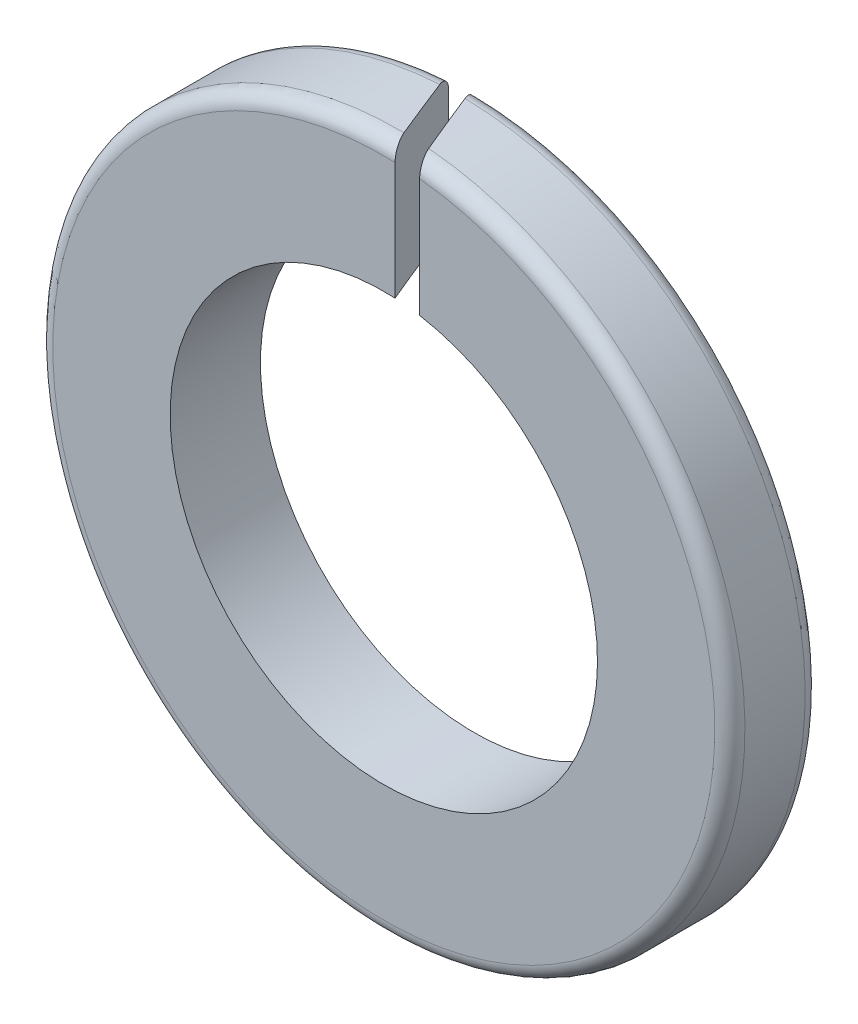
ISO-10303-21;
HEADER;
FILE_DESCRIPTION(('STEP AP214'),'2;1');
FILE_NAME('part.step','',(''),(''),'','','');
FILE_SCHEMA(('AUTOMOTIVE_DESIGN { 1 0 10303 214 1 1 1 1 }'));
ENDSEC;
DATA;
#1=APPLICATION_CONTEXT('core data for automotive mechanical design processes');
#2=APPLICATION_PROTOCOL_DEFINITION('international standard','automotive_design',2000,#1);
#3=PRODUCT_CONTEXT('',#1,'mechanical');
#4=PRODUCT('Part','Part','',(#3));
#5=PRODUCT_RELATED_PRODUCT_CATEGORY('part','',(#4));
#6=PRODUCT_DEFINITION_FORMATION('','',#4);
#7=PRODUCT_DEFINITION_CONTEXT('part definition',#1,'design');
#8=PRODUCT_DEFINITION('design','',#6,#7);
#9=PRODUCT_DEFINITION_SHAPE('','',#8);
#10=(LENGTH_UNIT() NAMED_UNIT(*) SI_UNIT(.MILLI.,.METRE.));
#11=(NAMED_UNIT(*) PLANE_ANGLE_UNIT() SI_UNIT($,.RADIAN.));
#12=(NAMED_UNIT(*) SI_UNIT($,.STERADIAN.) SOLID_ANGLE_UNIT());
#13=UNCERTAINTY_MEASURE_WITH_UNIT(LENGTH_MEASURE(1.E-05),#10,'distance_accuracy_value','');
#14=(GEOMETRIC_REPRESENTATION_CONTEXT(3) GLOBAL_UNCERTAINTY_ASSIGNED_CONTEXT((#13)) GLOBAL_UNIT_ASSIGNED_CONTEXT((#10,
#11,#12)) REPRESENTATION_CONTEXT('',''));
#15=CARTESIAN_POINT('',(0.,0.,0.));
#16=DIRECTION('',(0.,0.,1.));
#17=DIRECTION('',(1.,0.,0.));
#18=AXIS2_PLACEMENT_3D('',#15,#16,#17);
#19=CARTESIAN_POINT('',(0.,0.,3.));
#20=DIRECTION('',(0.,0.,1.));
#21=DIRECTION('',(1.,0.,0.));
#22=AXIS2_PLACEMENT_3D('',#19,#20,#21);
#23=PLANE('',#22);
#24=CARTESIAN_POINT('',(0.,0.,3.));
#25=DIRECTION('',(0.,0.,1.));
#26=DIRECTION('',(1.,0.,0.));
#27=AXIS2_PLACEMENT_3D('',#24,#25,#26);
#28=CIRCLE('',#27,7.1);
#29=CARTESIAN_POINT('',(0.373498300515705,7.09016918130392,3.));
#30=VERTEX_POINT('',#29);
#31=CARTESIAN_POINT('',(1.19000632074208,6.99956319755696,3.));
#32=VERTEX_POINT('',#31);
#33=EDGE_CURVE('E104',#30,#32,#28,.T.);
#34=ORIENTED_EDGE('',*,*,#33,.F.);
#35=DIRECTION('',(0.,1.,0.));
#36=VECTOR('',#35,1.);
#37=CARTESIAN_POINT('',(0.373498300515705,0.,3.));
#38=LINE('',#37,#36);
#39=CARTESIAN_POINT('',(0.373498300515705,10.9936572176647,3.));
#40=VERTEX_POINT('',#39);
#41=EDGE_CURVE('E152',#30,#40,#38,.T.);
#42=ORIENTED_EDGE('',*,*,#41,.T.);
#43=CARTESIAN_POINT('',(0.,0.,3.));
#44=DIRECTION('',(0.,0.,1.));
#45=DIRECTION('',(1.,0.,0.));
#46=AXIS2_PLACEMENT_3D('',#43,#44,#45);
#47=CIRCLE('',#46,11.);
#48=CARTESIAN_POINT('',(1.19000632074208,10.935441690055,3.));
#49=VERTEX_POINT('',#48);
#50=EDGE_CURVE('E95',#40,#49,#47,.T.);
#51=ORIENTED_EDGE('',*,*,#50,.T.);
#52=DIRECTION('',(0.,-1.,0.));
#53=VECTOR('',#52,1.);
#54=CARTESIAN_POINT('',(1.19000632074208,0.,3.));
#55=LINE('',#54,#53);
#56=EDGE_CURVE('E53',#49,#32,#55,.T.);
#57=ORIENTED_EDGE('',*,*,#56,.T.);
#58=EDGE_LOOP('',(#34,#42,#51,#57));
#59=FACE_BOUND('',#58,.T.);
#60=ADVANCED_FACE('F33',(#59),#23,.T.);
#61=CARTESIAN_POINT('',(0.,0.,0.));
#62=DIRECTION('',(0.,0.,1.));
#63=DIRECTION('',(1.,0.,0.));
#64=AXIS2_PLACEMENT_3D('',#61,#62,#63);
#65=PLANE('',#64);
#66=DIRECTION('',(0.,1.,0.));
#67=VECTOR('',#66,1.);
#68=CARTESIAN_POINT('',(-0.845251699484295,0.,0.));
#69=LINE('',#68,#67);
#70=CARTESIAN_POINT('',(-0.845251699484295,7.04950704407896,0.));
#71=VERTEX_POINT('',#70);
#72=CARTESIAN_POINT('',(-0.845251699484295,10.9674769005692,0.));
#73=VERTEX_POINT('',#72);
#74=EDGE_CURVE('E156',#71,#73,#69,.T.);
#75=ORIENTED_EDGE('',*,*,#74,.F.);
#76=CARTESIAN_POINT('',(0.,0.,0.));
#77=DIRECTION('',(0.,0.,1.));
#78=DIRECTION('',(1.,0.,0.));
#79=AXIS2_PLACEMENT_3D('',#76,#77,#78);
#80=CIRCLE('',#79,7.1);
#81=CARTESIAN_POINT('',(-0.00195796497220551,7.09999973002627,0.));
#82=VERTEX_POINT('',#81);
#83=EDGE_CURVE('E109',#71,#82,#80,.T.);
#84=ORIENTED_EDGE('',*,*,#83,.T.);
#85=DIRECTION('',(0.,-1.,0.));
#86=VECTOR('',#85,1.);
#87=CARTESIAN_POINT('',(-0.00195796497220559,0.,0.));
#88=LINE('',#87,#86);
#89=CARTESIAN_POINT('',(-0.00195796497220562,10.9999998257442,0.));
#90=VERTEX_POINT('',#89);
#91=EDGE_CURVE('E163',#90,#82,#88,.T.);
#92=ORIENTED_EDGE('',*,*,#91,.F.);
#93=CARTESIAN_POINT('',(0.,0.,0.));
#94=DIRECTION('',(0.,0.,1.));
#95=DIRECTION('',(1.,0.,0.));
#96=AXIS2_PLACEMENT_3D('',#93,#94,#95);
#97=CIRCLE('',#96,11.);
#98=EDGE_CURVE('E106',#90,#73,#97,.F.);
#99=ORIENTED_EDGE('',*,*,#98,.T.);
#100=EDGE_LOOP('',(#75,#84,#92,#99));
#101=FACE_BOUND('',#100,.T.);
#102=ADVANCED_FACE('F162',(#101),#65,.F.);
#103=CARTESIAN_POINT('',(0.,0.,3.));
#104=DIRECTION('',(0.,0.,-1.));
#105=DIRECTION('',(-1.,0.,0.));
#106=AXIS2_PLACEMENT_3D('',#103,#104,#105);
#107=CYLINDRICAL_SURFACE('',#106,11.5);
#108=CARTESIAN_POINT('',(0.,0.,2.08061956796134));
#109=DIRECTION('',(0.926466577122309,0.,-0.376377046955938));
#110=DIRECTION('',(-0.376377046955938,0.,-0.926466577122309));
#111=AXIS2_PLACEMENT_3D('',#108,#109,#110);
#112=ELLIPSE('',#111,30.5544668385325,11.5);
#113=CARTESIAN_POINT('',(-0.642126699484295,11.4820587571136,0.5));
#114=VERTEX_POINT('',#113);
#115=CARTESIAN_POINT('',(0.170373300515705,11.4987378845885,2.5));
#116=VERTEX_POINT('',#115);
#117=EDGE_CURVE('E61',#114,#116,#112,.T.);
#118=ORIENTED_EDGE('',*,*,#117,.F.);
#119=CARTESIAN_POINT('',(0.,0.,0.5));
#120=DIRECTION('',(0.,0.,1.));
#121=DIRECTION('',(1.,0.,0.));
#122=AXIS2_PLACEMENT_3D('',#119,#120,#121);
#123=CIRCLE('',#122,11.5);
#124=CARTESIAN_POINT('',(0.196702749313509,11.4983176173044,0.5));
#125=VERTEX_POINT('',#124);
#126=EDGE_CURVE('E101',#114,#125,#123,.T.);
#127=ORIENTED_EDGE('',*,*,#126,.T.);
#128=CARTESIAN_POINT('',(0.,0.,0.00492791184015769));
#129=DIRECTION('',(-0.929332584688145,0.,0.369243750166272));
#130=DIRECTION('',(-0.369243750166272,0.,-0.929332584688145));
#131=AXIS2_PLACEMENT_3D('',#128,#129,#130);
#132=ELLIPSE('',#131,31.1447383870993,11.5);
#133=CARTESIAN_POINT('',(0.991345606456366,11.4571913612613,2.5));
#134=VERTEX_POINT('',#133);
#135=EDGE_CURVE('E89',#134,#125,#132,.T.);
#136=ORIENTED_EDGE('',*,*,#135,.F.);
#137=CARTESIAN_POINT('',(0.,0.,2.5));
#138=DIRECTION('',(0.,0.,1.));
#139=DIRECTION('',(1.,0.,0.));
#140=AXIS2_PLACEMENT_3D('',#137,#138,#139);
#141=CIRCLE('',#140,11.5);
#142=EDGE_CURVE('E99',#134,#116,#141,.F.);
#143=ORIENTED_EDGE('',*,*,#142,.T.);
#144=EDGE_LOOP('',(#118,#127,#136,#143));
#145=FACE_BOUND('',#144,.T.);
#146=ADVANCED_FACE('F35',(#145),#107,.T.);
#147=CARTESIAN_POINT('',(0.,0.,3.));
#148=DIRECTION('',(0.,0.,-1.));
#149=DIRECTION('',(-1.,0.,0.));
#150=AXIS2_PLACEMENT_3D('',#147,#148,#149);
#151=CYLINDRICAL_SURFACE('',#150,7.1);
#152=ORIENTED_EDGE('',*,*,#83,.F.);
#153=CARTESIAN_POINT('',(0.,0.,2.08061956796134));
#154=DIRECTION('',(0.926466577122309,0.,-0.376377046955938));
#155=DIRECTION('',(-0.376377046955938,0.,-0.926466577122309));
#156=AXIS2_PLACEMENT_3D('',#153,#154,#155);
#157=ELLIPSE('',#156,18.864062135094,7.1);
#158=EDGE_CURVE('E151',#71,#30,#157,.T.);
#159=ORIENTED_EDGE('',*,*,#158,.T.);
#160=ORIENTED_EDGE('',*,*,#33,.T.);
#161=CARTESIAN_POINT('',(0.,0.,0.00492791184015769));
#162=DIRECTION('',(-0.929332584688145,0.,0.369243750166272));
#163=DIRECTION('',(-0.369243750166272,0.,-0.929332584688145));
#164=AXIS2_PLACEMENT_3D('',#161,#162,#163);
#165=ELLIPSE('',#164,19.2284906563831,7.1);
#166=EDGE_CURVE('E133',#32,#82,#165,.T.);
#167=ORIENTED_EDGE('',*,*,#166,.T.);
#168=EDGE_LOOP('',(#152,#159,#160,#167));
#169=FACE_BOUND('',#168,.T.);
#170=ADVANCED_FACE('F139',(#169),#151,.F.);
#171=CARTESIAN_POINT('',(0.,0.,0.5));
#172=DIRECTION('',(0.,0.,1.));
#173=DIRECTION('',(1.,0.,0.));
#174=AXIS2_PLACEMENT_3D('',#171,#172,#173);
#175=TOROIDAL_SURFACE('',#174,11.,0.5);
#176=ORIENTED_EDGE('',*,*,#126,.F.);
#177=CARTESIAN_POINT('',(-0.642045449484269,11.4820632606164,0.500200000000063));
#178=CARTESIAN_POINT('',(-0.654258598702899,11.4814079493409,0.470136863461899));
#179=CARTESIAN_POINT('',(-0.666448630020751,11.4779885558861,0.440130632525647));
#180=CARTESIAN_POINT('',(-0.690453588405312,11.4658030531494,0.38104150419442));
#181=CARTESIAN_POINT('',(-0.702268231221579,11.4570329891969,0.351959306492839));
#182=CARTESIAN_POINT('',(-0.725182290631446,11.4343213584534,0.295555467945474));
#183=CARTESIAN_POINT('',(-0.73628121322523,11.4203762636952,0.268235043099237));
#184=CARTESIAN_POINT('',(-0.757410259268984,11.3876308916428,0.21622508360692));
#185=CARTESIAN_POINT('',(-0.767440892145689,11.3688329432655,0.191534294987338));
#186=CARTESIAN_POINT('',(-0.785883814858542,11.3272874138575,0.14613633138647));
#187=CARTESIAN_POINT('',(-0.794327519018434,11.3046385434662,0.125351828839042));
#188=CARTESIAN_POINT('',(-0.809549754047361,11.2556719825768,0.0878817118447604));
#189=CARTESIAN_POINT('',(-0.816328618319865,11.2293550283126,0.071195276712444));
#190=CARTESIAN_POINT('',(-0.827552004878265,11.1755646815616,0.0435684790302295));
#191=CARTESIAN_POINT('',(-0.832116630347222,11.1482684304085,0.0323324778758724));
#192=CARTESIAN_POINT('',(-0.839300624376227,11.0919253940938,0.014648800266015));
#193=CARTESIAN_POINT('',(-0.841921121472144,11.0628796350985,0.00819834587606359));
#194=CARTESIAN_POINT('',(-0.84495108842966,11.0061669881357,0.000739965672949131));
#195=CARTESIAN_POINT('',(-0.845509034615094,10.9785558595512,-0.00063344032196663));
#196=CARTESIAN_POINT('',(-0.844775665753036,10.9235091427653,0.00117177533848285));
#197=CARTESIAN_POINT('',(-0.843484979174917,10.8960734980902,0.00434884999231517));
#198=CARTESIAN_POINT('',(-0.839193262112444,10.8435709524997,0.0149130766076351));
#199=CARTESIAN_POINT('',(-0.836278747290321,10.8184537893962,0.0220872669390125));
#200=CARTESIAN_POINT('',(-0.828901461509359,10.7698832595926,0.0402467396306129));
#201=CARTESIAN_POINT('',(-0.824438779767461,10.7464297971114,0.0512318023798998));
#202=CARTESIAN_POINT('',(-0.814122993606206,10.7018216185503,0.0766245067768358));
#203=CARTESIAN_POINT('',(-0.808270868633419,10.6806652984093,0.0910297374790807));
#204=CARTESIAN_POINT('',(-0.795368867580067,10.6411184568394,0.122788509302716));
#205=CARTESIAN_POINT('',(-0.788318852954329,10.6227282557977,0.140142391458378));
#206=CARTESIAN_POINT('',(-0.772878812974318,10.5882703239843,0.178148643716866));
#207=CARTESIAN_POINT('',(-0.764441218656654,10.5723533453591,0.198918106652654));
#208=CARTESIAN_POINT('',(-0.746736030224175,10.5441935762421,0.242500108947988));
#209=CARTESIAN_POINT('',(-0.737467936432077,10.5319530172344,0.265313878282383));
#210=CARTESIAN_POINT('',(-0.717610771744344,10.5104999214882,0.314193052898342));
#211=CARTESIAN_POINT('',(-0.706974941007266,10.5015933408212,0.340373559328071));
#212=CARTESIAN_POINT('',(-0.685323320526046,10.4882954696662,0.393669855897229));
#213=CARTESIAN_POINT('',(-0.674307910757505,10.4838997919176,0.420784710712098));
#214=CARTESIAN_POINT('',(-0.656183371810496,10.4803724828599,0.465398960427812));
#215=CARTESIAN_POINT('',(-0.649108213201116,10.4799089833551,0.482814735466288));
#216=CARTESIAN_POINT('',(-0.642045449484295,10.4803520208434,0.5002));
#217=B_SPLINE_CURVE_WITH_KNOTS('',3,(#177,#178,#179,#180,#181,#182,#183,#184,#185,#186,#187,
#188,#189,#190,#191,#192,#193,#194,#195,#196,#197,#198,#199,#200,#201,#202,#203,#204,#205,#206,
#207,#208,#209,#210,#211,#212,#213,#214,#215,#216),.UNSPECIFIED.,.F.,.F.,(4,2,2,2,2,2,2,2,2,2,2,
2,2,2,2,2,2,2,2,4),(0.,0.0972475119019454,0.194566986476512,0.291952928775857,0.389292221506854,
0.484434735523902,0.579558180585539,0.668692385709213,0.757774809260905,0.84030370202262,
0.922804544555464,1.00128037091192,1.07975167565607,1.15816782777434,1.23659305550626,
1.31872306694173,1.40090282872552,1.48941417991641,1.57783936400169,1.63415624704543),.UNSPECIFIED.);
#218=EDGE_CURVE('E144',#114,#73,#217,.T.);
#219=ORIENTED_EDGE('',*,*,#218,.T.);
#220=ORIENTED_EDGE('',*,*,#98,.F.);
#221=CARTESIAN_POINT('',(0.196782213599223,10.4981559142742,0.5002));
#222=CARTESIAN_POINT('',(0.184840524327013,10.4983544356306,0.470144512393539));
#223=CARTESIAN_POINT('',(0.172903254503782,10.501269176974,0.440100147894619));
#224=CARTESIAN_POINT('',(0.149351366721263,10.5124248351066,0.380823486509402));
#225=CARTESIAN_POINT('',(0.13773736431382,10.5206752728726,0.351592738877188));
#226=CARTESIAN_POINT('',(0.115177644494427,10.5424073605665,0.294813219331749));
#227=CARTESIAN_POINT('',(0.104232732686036,10.5558951782487,0.267266475005013));
#228=CARTESIAN_POINT('',(0.0833891069205121,10.5878478223105,0.214806113527739));
#229=CARTESIAN_POINT('',(0.073489502527608,10.6063083643249,0.189890255280429));
#230=CARTESIAN_POINT('',(0.0554647758965463,10.64697742217,0.144524651175285));
#231=CARTESIAN_POINT('',(0.0472843708547675,10.6690057208408,0.123935766575753));
#232=CARTESIAN_POINT('',(0.0325439096800775,10.7167450702245,0.0868361789001284));
#233=CARTESIAN_POINT('',(0.0259833476350243,10.7424549671205,0.0703242025170731));
#234=CARTESIAN_POINT('',(0.0152159702409845,10.7946781996552,0.0432242863792649));
#235=CARTESIAN_POINT('',(0.0108663727743136,10.820975667088,0.032276984890116));
#236=CARTESIAN_POINT('',(0.00399130366541016,10.8752623550262,0.0149734401665838));
#237=CARTESIAN_POINT('',(0.00146487187155355,10.9032506766315,0.0086147803708095));
#238=CARTESIAN_POINT('',(-0.00154567826620442,10.9581304050994,0.00103766541735132));
#239=CARTESIAN_POINT('',(-0.00215346296880821,10.9849724752675,-0.000492039901561273));
#240=CARTESIAN_POINT('',(-0.00165265275161766,11.0385366929726,0.000768426263053348));
#241=CARTESIAN_POINT('',(-0.000544341269587974,11.0652588595825,0.00355788437512795));
#242=CARTESIAN_POINT('',(0.00329645701667003,11.1171792120136,0.013224612646159));
#243=CARTESIAN_POINT('',(0.00599052706983755,11.142398394688,0.020005193454131));
#244=CARTESIAN_POINT('',(0.0128686090356349,11.1912960147816,0.037316321098385));
#245=CARTESIAN_POINT('',(0.0170527247152368,11.2149743447596,0.0478471291009785));
#246=CARTESIAN_POINT('',(0.0268791465770279,11.2607450781902,0.0725787976070598));
#247=CARTESIAN_POINT('',(0.0325535684149154,11.2827867956512,0.0868604885248891));
#248=CARTESIAN_POINT('',(0.0451208046144628,11.3241487632521,0.118490386375435));
#249=CARTESIAN_POINT('',(0.0520138185043986,11.3434685667824,0.135839095491678));
#250=CARTESIAN_POINT('',(0.0672247795641615,11.3799930971878,0.174122862653328));
#251=CARTESIAN_POINT('',(0.0756005657968464,11.3970210083396,0.195203493171547));
#252=CARTESIAN_POINT('',(0.0932379481339279,11.4273068646902,0.239594208267123));
#253=CARTESIAN_POINT('',(0.102500083463882,11.4405624952225,0.262905649996446));
#254=CARTESIAN_POINT('',(0.122295134286453,11.4638261968672,0.312726901504937));
#255=CARTESIAN_POINT('',(0.132871572070997,11.4735625291413,0.3393462505357));
#256=CARTESIAN_POINT('',(0.154449266408469,11.4883365701895,0.393654155385069));
#257=CARTESIAN_POINT('',(0.165449996428648,11.4933799190766,0.421341385997654));
#258=CARTESIAN_POINT('',(0.183260342713089,11.4976883670423,0.466167426084338));
#259=CARTESIAN_POINT('',(0.19002427805355,11.4984428089321,0.483191263345722));
#260=CARTESIAN_POINT('',(0.196782213599166,11.4983162176212,0.500199999999855));
#261=B_SPLINE_CURVE_WITH_KNOTS('',3,(#221,#222,#223,#224,#225,#226,#227,#228,#229,#230,#231,
#232,#233,#234,#235,#236,#237,#238,#239,#240,#241,#242,#243,#244,#245,#246,#247,#248,#249,#250,
#251,#252,#253,#254,#255,#256,#257,#258,#259,#260),.UNSPECIFIED.,.F.,.F.,(4,2,2,2,2,2,2,2,2,2,2,
2,2,2,2,2,2,2,2,4),(0.,0.0969234614036401,0.194020351290687,0.29123193496591,0.388360030178622,
0.481588855734962,0.574788526967835,0.66078116643724,0.746728485643605,0.827009376641412,
0.907277009519187,0.985675758479521,1.06407996820697,1.14433655389804,1.22460629273142,
1.30932947824777,1.39410453825625,1.48446895604375,1.57472463142885,1.62963714386343),.UNSPECIFIED.);
#262=EDGE_CURVE('E127',#90,#125,#261,.T.);
#263=ORIENTED_EDGE('',*,*,#262,.T.);
#264=EDGE_LOOP('',(#176,#219,#220,#263));
#265=FACE_BOUND('',#264,.T.);
#266=ADVANCED_FACE('F135',(#265),#175,.T.);
#267=CARTESIAN_POINT('',(0.,0.,2.5));
#268=DIRECTION('',(0.,0.,1.));
#269=DIRECTION('',(1.,0.,0.));
#270=AXIS2_PLACEMENT_3D('',#267,#268,#269);
#271=TOROIDAL_SURFACE('',#270,11.,0.5);
#272=ORIENTED_EDGE('',*,*,#50,.F.);
#273=CARTESIAN_POINT('',(0.170292050515706,10.4986190262116,2.4998));
#274=CARTESIAN_POINT('',(0.182426866479166,10.4983965802133,2.52967031621775));
#275=CARTESIAN_POINT('',(0.194572976766152,10.5008571972904,2.55956843384725));
#276=CARTESIAN_POINT('',(0.218572451534017,10.5110894591666,2.61864406404508));
#277=CARTESIAN_POINT('',(0.230425063930798,10.5188735266596,2.64781972532946));
#278=CARTESIAN_POINT('',(0.253479656949201,10.5397138530918,2.70456949275937));
#279=CARTESIAN_POINT('',(0.264680621623713,10.5527781047396,2.73214109811202));
#280=CARTESIAN_POINT('',(0.286028456761222,10.5839612407333,2.78468961537358));
#281=CARTESIAN_POINT('',(0.296176455652219,10.6020746356807,2.80966930495142));
#282=CARTESIAN_POINT('',(0.314570606170966,10.6419617373565,2.85494721392064));
#283=CARTESIAN_POINT('',(0.322886230703745,10.6635086774374,2.87541644353979));
#284=CARTESIAN_POINT('',(0.337889111913778,10.7103013823043,2.91234661267218));
#285=CARTESIAN_POINT('',(0.344576902475804,10.7355459300139,2.92880886636332));
#286=CARTESIAN_POINT('',(0.355548790207243,10.7867606325926,2.95581659000994));
#287=CARTESIAN_POINT('',(0.359985294708997,10.8125005240696,2.96673721647579));
#288=CARTESIAN_POINT('',(0.367046203941112,10.8656753927043,2.98411791612408));
#289=CARTESIAN_POINT('',(0.369671513371886,10.8931095161129,2.99058021626137));
#290=CARTESIAN_POINT('',(0.372900637940848,10.9470758901224,2.99852883058497));
#291=CARTESIAN_POINT('',(0.373618434732435,10.9735604391486,3.00029571499502));
#292=CARTESIAN_POINT('',(0.373345391210288,11.0264647097484,2.99962360786359));
#293=CARTESIAN_POINT('',(0.372354732651719,11.0528844379184,2.99718506371942));
#294=CARTESIAN_POINT('',(0.368739773091155,11.1045650762852,2.98828670172418));
#295=CARTESIAN_POINT('',(0.366136624721639,11.1298365138604,2.98187895189153));
#296=CARTESIAN_POINT('',(0.359422544456408,11.1789196864832,2.96535198508481));
#297=CARTESIAN_POINT('',(0.355311435125056,11.2027312493684,2.95523233134609));
#298=CARTESIAN_POINT('',(0.34556495473302,11.2491123445685,2.93124099499647));
#299=CARTESIAN_POINT('',(0.339882242556749,11.2716115025564,2.91725278040872));
#300=CARTESIAN_POINT('',(0.327254860712945,11.3139465987245,2.88616999433167));
#301=CARTESIAN_POINT('',(0.320309940946946,11.3337820077429,2.86907480721536));
#302=CARTESIAN_POINT('',(0.304895534627047,11.3715541466349,2.83113165319715));
#303=CARTESIAN_POINT('',(0.296357812672918,11.3892942020428,2.81011572223314));
#304=CARTESIAN_POINT('',(0.278338907987598,11.4210035100701,2.76576149531543));
#305=CARTESIAN_POINT('',(0.268857141109514,11.4349704078765,2.74242176146168));
#306=CARTESIAN_POINT('',(0.248536052332551,11.459702190482,2.69240061985685));
#307=CARTESIAN_POINT('',(0.237648278545026,11.4701860692278,2.66559994591833));
#308=CARTESIAN_POINT('',(0.215394802584977,11.4863803378908,2.61082215893975));
#309=CARTESIAN_POINT('',(0.204029687016428,11.4920964165109,2.58284648984793));
#310=CARTESIAN_POINT('',(0.185170125755269,11.4975214985172,2.53642295443585));
#311=CARTESIAN_POINT('',(0.177730178817953,11.498640917965,2.51810923889784));
#312=CARTESIAN_POINT('',(0.170292050515665,11.4987390481535,2.4997999999999));
#313=B_SPLINE_CURVE_WITH_KNOTS('',3,(#273,#274,#275,#276,#277,#278,#279,#280,#281,#282,#283,
#284,#285,#286,#287,#288,#289,#290,#291,#292,#293,#294,#295,#296,#297,#298,#299,#300,#301,#302,
#303,#304,#305,#306,#307,#308,#309,#310,#311,#312),.UNSPECIFIED.,.F.,.F.,(4,2,2,2,2,2,2,2,2,2,2,
2,2,2,2,2,2,2,2,4),(0.,0.0966369699071597,0.193500222813734,0.290510651796442,0.387416020231388,
0.479503285448333,0.571560307756013,0.656049391106347,0.740496241148698,0.819770019154695,
0.899035364087085,0.977282304749722,1.05553845536687,1.13647221808249,1.21742203483047,
1.30344091607417,1.38951335799378,1.48141654450723,1.57320991919731,1.63249777980639),.UNSPECIFIED.);
#314=EDGE_CURVE('E11',#40,#116,#313,.T.);
#315=ORIENTED_EDGE('',*,*,#314,.T.);
#316=ORIENTED_EDGE('',*,*,#142,.F.);
#317=CARTESIAN_POINT('',(0.991266142170651,11.4571981965656,2.4998));
#318=CARTESIAN_POINT('',(1.00325111850337,11.4561887478681,2.52996443481492));
#319=CARTESIAN_POINT('',(1.01519988626281,11.4523940769567,2.56003773793982));
#320=CARTESIAN_POINT('',(1.03870012844334,11.4394593605751,2.61918441488857));
#321=CARTESIAN_POINT('',(1.05025149310969,11.4303178507666,2.64825751247578));
#322=CARTESIAN_POINT('',(1.07262968367346,11.4069105601048,2.70458014940034));
#323=CARTESIAN_POINT('',(1.0834562124325,11.3926426928336,2.73182894088376));
#324=CARTESIAN_POINT('',(1.10405422169916,11.3593285977299,2.78367112150996));
#325=CARTESIAN_POINT('',(1.11382602972211,11.340283859368,2.80826533496097));
#326=CARTESIAN_POINT('',(1.13187142102771,11.2981536114248,2.85368294903349));
#327=CARTESIAN_POINT('',(1.14016359829317,11.2751266732693,2.87455314799375));
#328=CARTESIAN_POINT('',(1.15510352856649,11.2254323674295,2.9121547702547));
#329=CARTESIAN_POINT('',(1.1617515406139,11.198765574236,2.92888684552008));
#330=CARTESIAN_POINT('',(1.17279257494797,11.1441243029033,2.95667551620359));
#331=CARTESIAN_POINT('',(1.17729080185834,11.1163060388403,2.96799689629261));
#332=CARTESIAN_POINT('',(1.18434293443924,11.0589162316582,2.98574608391194));
#333=CARTESIAN_POINT('',(1.18689794414243,11.0293456943975,2.99217667013122));
#334=CARTESIAN_POINT('',(1.18979598302011,10.9716515264411,2.99947061067729));
#335=CARTESIAN_POINT('',(1.19028883695548,10.9435829598597,3.00071105204271));
#336=CARTESIAN_POINT('',(1.18941465462577,10.8876601987768,2.99851086280838));
#337=CARTESIAN_POINT('',(1.18804836211411,10.85980592303,2.99507210412736));
#338=CARTESIAN_POINT('',(1.18361016029261,10.806786276661,2.98390179841931));
#339=CARTESIAN_POINT('',(1.18063988549094,10.781558130529,2.97642605060386));
#340=CARTESIAN_POINT('',(1.17315716853875,10.7328427103964,2.95759314501634));
#341=CARTESIAN_POINT('',(1.16864490987758,10.7093552296686,2.94623644906014));
#342=CARTESIAN_POINT('',(1.15829330450835,10.6650389675012,2.92018297037803));
#343=CARTESIAN_POINT('',(1.15247065360149,10.6441814875064,2.90552820854504));
#344=CARTESIAN_POINT('',(1.1396585887894,10.6052933275133,2.87328211283819));
#345=CARTESIAN_POINT('',(1.1326690902917,10.5872628526471,2.85569056605748));
#346=CARTESIAN_POINT('',(1.11745380466659,10.5537652314207,2.81739591459653));
#347=CARTESIAN_POINT('',(1.1091912595085,10.5384208147535,2.79660029532222));
#348=CARTESIAN_POINT('',(1.09188173486414,10.5114096873416,2.75303475014991));
#349=CARTESIAN_POINT('',(1.08283430111943,10.4997451246824,2.73026368094972));
#350=CARTESIAN_POINT('',(1.06351736389647,10.4795192392017,2.68164577153464));
#351=CARTESIAN_POINT('',(1.05320684657506,10.4712457974634,2.65569570546727));
#352=CARTESIAN_POINT('',(1.03224843987902,10.4591426235101,2.60294645715364));
#353=CARTESIAN_POINT('',(1.02160088825365,10.4553085788051,2.57614812497294));
#354=CARTESIAN_POINT('',(1.00436881367328,10.4526591207337,2.53277751029874));
#355=CARTESIAN_POINT('',(0.997810007146724,10.4524740377487,2.51626995229933));
#356=CARTESIAN_POINT('',(0.991266142170655,10.4531044324347,2.49980000000001));
#357=B_SPLINE_CURVE_WITH_KNOTS('',3,(#317,#318,#319,#320,#321,#322,#323,#324,#325,#326,#327,
#328,#329,#330,#331,#332,#333,#334,#335,#336,#337,#338,#339,#340,#341,#342,#343,#344,#345,#346,
#347,#348,#349,#350,#351,#352,#353,#354,#355,#356),.UNSPECIFIED.,.F.,.F.,(4,2,2,2,2,2,2,2,2,2,2,
2,2,2,2,2,2,2,2,4),(0.,0.0972910655175087,0.19460878861689,0.291966164798859,0.389293221744549,
0.485294615034589,0.581280873579766,0.671906294868568,0.762480189070617,0.846345221642493,
0.930176713784713,1.00923092482769,1.08827573203868,1.16636534113491,1.2444606139207,
1.32550934404532,1.40660529854884,1.49360748575163,1.58052508676756,1.63373426024255),.UNSPECIFIED.);
#358=EDGE_CURVE('E46',#134,#49,#357,.T.);
#359=ORIENTED_EDGE('',*,*,#358,.T.);
#360=EDGE_LOOP('',(#272,#315,#316,#359));
#361=FACE_BOUND('',#360,.T.);
#362=ADVANCED_FACE('F103',(#361),#271,.T.);
#363=CARTESIAN_POINT('',(-0.862634786685419,11.5,-2.16619784341303));
#364=DIRECTION('',(-0.929332584688145,0.,0.369243750166272));
#365=DIRECTION('',(0.369243750166272,0.,0.929332584688145));
#366=AXIS2_PLACEMENT_3D('',#363,#364,#365);
#367=PLANE('',#366);
#368=ORIENTED_EDGE('',*,*,#91,.T.);
#369=ORIENTED_EDGE('',*,*,#166,.F.);
#370=ORIENTED_EDGE('',*,*,#56,.F.);
#371=ORIENTED_EDGE('',*,*,#358,.F.);
#372=ORIENTED_EDGE('',*,*,#135,.T.);
#373=ORIENTED_EDGE('',*,*,#262,.F.);
#374=EDGE_LOOP('',(#368,#369,#370,#371,#372,#373));
#375=FACE_BOUND('',#374,.T.);
#376=ADVANCED_FACE('F88',(#375),#367,.T.);
#377=CARTESIAN_POINT('',(-1.72526957337084,11.5,-2.16619784341303));
#378=DIRECTION('',(0.926466577122309,0.,-0.376377046955938));
#379=DIRECTION('',(-0.376377046955938,0.,-0.926466577122309));
#380=AXIS2_PLACEMENT_3D('',#377,#378,#379);
#381=PLANE('',#380);
#382=ORIENTED_EDGE('',*,*,#74,.T.);
#383=ORIENTED_EDGE('',*,*,#218,.F.);
#384=ORIENTED_EDGE('',*,*,#117,.T.);
#385=ORIENTED_EDGE('',*,*,#314,.F.);
#386=ORIENTED_EDGE('',*,*,#41,.F.);
#387=ORIENTED_EDGE('',*,*,#158,.F.);
#388=EDGE_LOOP('',(#382,#383,#384,#385,#386,#387));
#389=FACE_BOUND('',#388,.T.);
#390=ADVANCED_FACE('F123',(#389),#381,.T.);
#391=CLOSED_SHELL('',(#60,#102,#146,#170,#266,#362,#376,#390));
#392=MANIFOLD_SOLID_BREP('B2',#391);
#393=ADVANCED_BREP_SHAPE_REPRESENTATION('',(#18,#392),#14);
#394=SHAPE_DEFINITION_REPRESENTATION(#9,#393);
ENDSEC;
END-ISO-10303-21;
